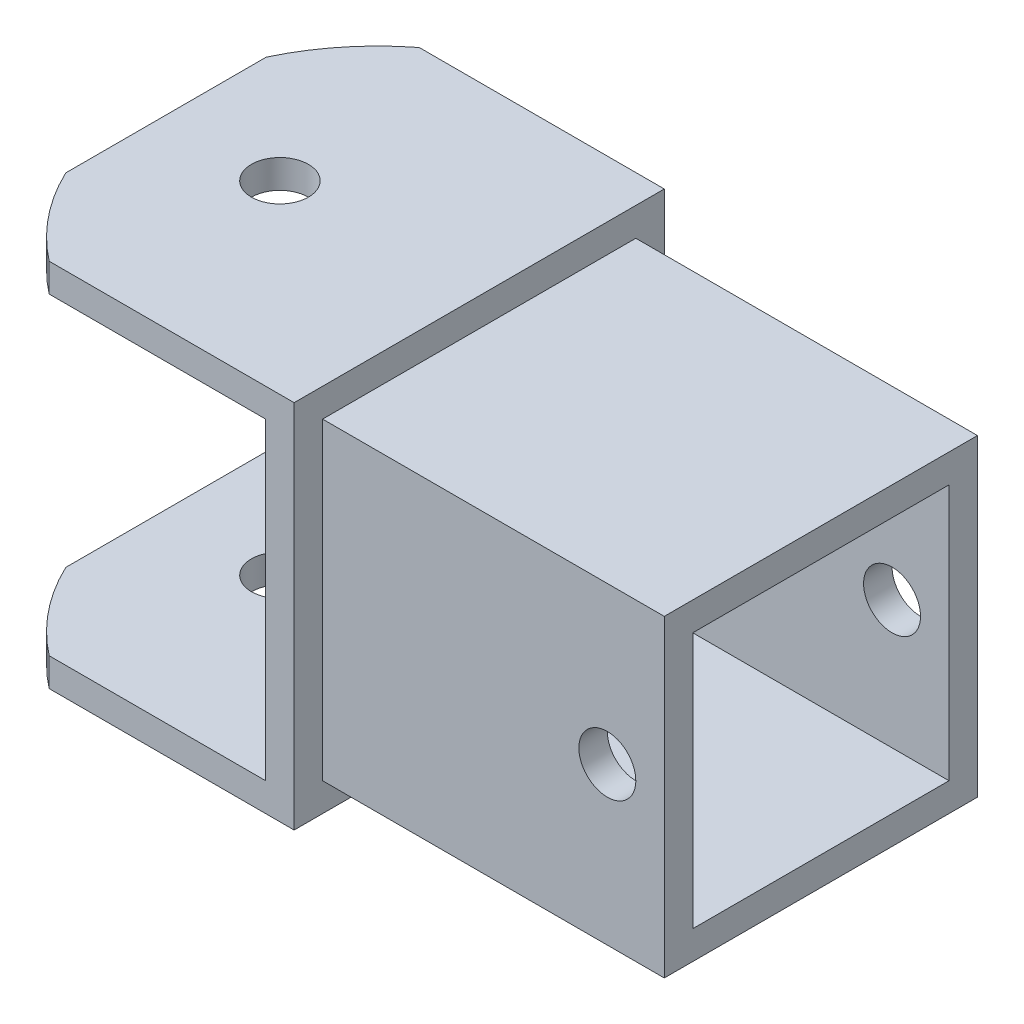
ISO-10303-21;
HEADER;
FILE_DESCRIPTION(('STEP AP214'),'2;1');
FILE_NAME('part.step','',(''),(''),'','','');
FILE_SCHEMA(('AUTOMOTIVE_DESIGN { 1 0 10303 214 1 1 1 1 }'));
ENDSEC;
DATA;
#1=APPLICATION_CONTEXT('core data for automotive mechanical design processes');
#2=APPLICATION_PROTOCOL_DEFINITION('international standard','automotive_design',2000,#1);
#3=PRODUCT_CONTEXT('',#1,'mechanical');
#4=PRODUCT('Part','Part','',(#3));
#5=PRODUCT_RELATED_PRODUCT_CATEGORY('part','',(#4));
#6=PRODUCT_DEFINITION_FORMATION('','',#4);
#7=PRODUCT_DEFINITION_CONTEXT('part definition',#1,'design');
#8=PRODUCT_DEFINITION('design','',#6,#7);
#9=PRODUCT_DEFINITION_SHAPE('','',#8);
#10=(LENGTH_UNIT() NAMED_UNIT(*) SI_UNIT(.MILLI.,.METRE.));
#11=(NAMED_UNIT(*) PLANE_ANGLE_UNIT() SI_UNIT($,.RADIAN.));
#12=(NAMED_UNIT(*) SI_UNIT($,.STERADIAN.) SOLID_ANGLE_UNIT());
#13=UNCERTAINTY_MEASURE_WITH_UNIT(LENGTH_MEASURE(1.E-05),#10,'distance_accuracy_value','');
#14=(GEOMETRIC_REPRESENTATION_CONTEXT(3) GLOBAL_UNCERTAINTY_ASSIGNED_CONTEXT((#13)) GLOBAL_UNIT_ASSIGNED_CONTEXT((#10,
#11,#12)) REPRESENTATION_CONTEXT('',''));
#15=CARTESIAN_POINT('',(0.,0.,0.));
#16=DIRECTION('',(0.,0.,1.));
#17=DIRECTION('',(1.,0.,0.));
#18=AXIS2_PLACEMENT_3D('',#15,#16,#17);
#19=CARTESIAN_POINT('',(-50.8,82.5502499999997,114.30025));
#20=DIRECTION('',(1.,0.,0.));
#21=DIRECTION('',(0.,1.,0.));
#22=AXIS2_PLACEMENT_3D('',#19,#20,#21);
#23=PLANE('',#22);
#24=DIRECTION('',(0.,-1.,0.));
#25=VECTOR('',#24,1.);
#26=CARTESIAN_POINT('',(-50.8,82.5502499999997,76.4548080116448));
#27=LINE('',#26,#25);
#28=CARTESIAN_POINT('',(-50.8,82.5502499999999,76.4548080116448));
#29=VERTEX_POINT('',#28);
#30=CARTESIAN_POINT('',(-50.8,69.8502499999999,76.4548080116448));
#31=VERTEX_POINT('',#30);
#32=EDGE_CURVE('E239',#29,#31,#27,.T.);
#33=ORIENTED_EDGE('',*,*,#32,.F.);
#34=DIRECTION('',(0.,0.,-1.));
#35=VECTOR('',#34,1.);
#36=CARTESIAN_POINT('',(-50.8,82.5502499999997,114.30025));
#37=LINE('',#36,#35);
#38=CARTESIAN_POINT('',(-50.8,82.5502500000002,-12.9543080116442));
#39=VERTEX_POINT('',#38);
#40=EDGE_CURVE('E197',#29,#39,#37,.T.);
#41=ORIENTED_EDGE('',*,*,#40,.T.);
#42=DIRECTION('',(0.,-1.,0.));
#43=VECTOR('',#42,1.);
#44=CARTESIAN_POINT('',(-50.8,82.55025,-12.9543080116442));
#45=LINE('',#44,#43);
#46=CARTESIAN_POINT('',(-50.8,69.8502500000002,-12.9543080116443));
#47=VERTEX_POINT('',#46);
#48=EDGE_CURVE('E313',#47,#39,#45,.F.);
#49=ORIENTED_EDGE('',*,*,#48,.F.);
#50=DIRECTION('',(0.,0.,-1.));
#51=VECTOR('',#50,1.);
#52=CARTESIAN_POINT('',(-50.8,69.8502499999997,114.30025));
#53=LINE('',#52,#51);
#54=EDGE_CURVE('E51',#31,#47,#53,.T.);
#55=ORIENTED_EDGE('',*,*,#54,.F.);
#56=EDGE_LOOP('',(#33,#41,#49,#55));
#57=FACE_BOUND('',#56,.T.);
#58=ADVANCED_FACE('F41',(#57),#23,.F.);
#59=CARTESIAN_POINT('',(-50.8,69.8502499999997,114.30025));
#60=DIRECTION('',(0.,1.,0.));
#61=DIRECTION('',(-1.,0.,0.));
#62=AXIS2_PLACEMENT_3D('',#59,#60,#61);
#63=PLANE('',#62);
#64=CARTESIAN_POINT('',(0.,69.85025,31.7502500000002));
#65=DIRECTION('',(0.,1.,0.));
#66=DIRECTION('',(-1.,0.,0.));
#67=AXIS2_PLACEMENT_3D('',#64,#65,#66);
#68=CIRCLE('',#67,12.7);
#69=CARTESIAN_POINT('',(-12.7,69.85025,31.7502500000002));
#70=VERTEX_POINT('',#69);
#71=EDGE_CURVE('E341',#70,#70,#68,.T.);
#72=ORIENTED_EDGE('',*,*,#71,.T.);
#73=EDGE_LOOP('',(#72));
#74=FACE_BOUND('',#73,.T.);
#75=CARTESIAN_POINT('',(43.5564957867523,69.85025,31.7502500000002));
#76=DIRECTION('',(0.,1.,0.));
#77=DIRECTION('',(-1.,0.,0.));
#78=AXIS2_PLACEMENT_3D('',#75,#76,#77);
#79=CIRCLE('',#78,104.410946764082);
#80=CARTESIAN_POINT('',(-20.3742738329848,69.8502499999997,114.30025));
#81=VERTEX_POINT('',#80);
#82=EDGE_CURVE('E67',#31,#81,#79,.T.);
#83=ORIENTED_EDGE('',*,*,#82,.F.);
#84=ORIENTED_EDGE('',*,*,#54,.T.);
#85=CARTESIAN_POINT('',(-20.3742738329847,69.8502500000003,-50.7997499999997));
#86=VERTEX_POINT('',#85);
#87=EDGE_CURVE('E310',#86,#47,#79,.T.);
#88=ORIENTED_EDGE('',*,*,#87,.F.);
#89=DIRECTION('',(1.,0.,0.));
#90=VECTOR('',#89,1.);
#91=CARTESIAN_POINT('',(-50.8,69.8502500000003,-50.7997499999997));
#92=LINE('',#91,#90);
#93=CARTESIAN_POINT('',(76.2,69.8502500000003,-50.7997499999997));
#94=VERTEX_POINT('',#93);
#95=EDGE_CURVE('E214',#86,#94,#92,.T.);
#96=ORIENTED_EDGE('',*,*,#95,.T.);
#97=DIRECTION('',(0.,0.,-1.));
#98=VECTOR('',#97,1.);
#99=CARTESIAN_POINT('',(76.2,69.8502499999997,114.30025));
#100=LINE('',#99,#98);
#101=CARTESIAN_POINT('',(76.2,69.8502499999997,114.30025));
#102=VERTEX_POINT('',#101);
#103=EDGE_CURVE('E243',#102,#94,#100,.T.);
#104=ORIENTED_EDGE('',*,*,#103,.F.);
#105=DIRECTION('',(1.,0.,0.));
#106=VECTOR('',#105,1.);
#107=CARTESIAN_POINT('',(-50.8,69.8502499999997,114.30025));
#108=LINE('',#107,#106);
#109=EDGE_CURVE('E267',#81,#102,#108,.T.);
#110=ORIENTED_EDGE('',*,*,#109,.F.);
#111=EDGE_LOOP('',(#83,#84,#88,#96,#104,#110));
#112=FACE_BOUND('',#111,.T.);
#113=ADVANCED_FACE('F457',(#74,#112),#63,.F.);
#114=CARTESIAN_POINT('',(76.2,-69.8497500000003,114.30025));
#115=DIRECTION('',(0.,-1.,0.));
#116=DIRECTION('',(1.,0.,0.));
#117=AXIS2_PLACEMENT_3D('',#114,#115,#116);
#118=PLANE('',#117);
#119=CARTESIAN_POINT('',(0.,-69.84975,31.7502499999998));
#120=DIRECTION('',(0.,-1.,0.));
#121=DIRECTION('',(1.,0.,0.));
#122=AXIS2_PLACEMENT_3D('',#119,#120,#121);
#123=CIRCLE('',#122,12.7);
#124=CARTESIAN_POINT('',(12.7,-69.84975,31.7502499999998));
#125=VERTEX_POINT('',#124);
#126=EDGE_CURVE('E337',#125,#125,#123,.T.);
#127=ORIENTED_EDGE('',*,*,#126,.T.);
#128=EDGE_LOOP('',(#127));
#129=FACE_BOUND('',#128,.T.);
#130=CARTESIAN_POINT('',(43.5564957867523,-69.84975,31.7502499999998));
#131=DIRECTION('',(0.,-1.,0.));
#132=DIRECTION('',(1.,0.,0.));
#133=AXIS2_PLACEMENT_3D('',#130,#131,#132);
#134=CIRCLE('',#133,104.410946764082);
#135=CARTESIAN_POINT('',(-20.3742738329847,-69.8497500000003,114.30025));
#136=VERTEX_POINT('',#135);
#137=CARTESIAN_POINT('',(-50.7999999999997,-69.8497500000001,76.4548080116449));
#138=VERTEX_POINT('',#137);
#139=EDGE_CURVE('E309',#136,#138,#134,.T.);
#140=ORIENTED_EDGE('',*,*,#139,.F.);
#141=DIRECTION('',(-1.,0.,0.));
#142=VECTOR('',#141,1.);
#143=CARTESIAN_POINT('',(76.2,-69.8497500000003,114.30025));
#144=LINE('',#143,#142);
#145=CARTESIAN_POINT('',(76.2,-69.8497500000003,114.30025));
#146=VERTEX_POINT('',#145);
#147=EDGE_CURVE('E433',#146,#136,#144,.T.);
#148=ORIENTED_EDGE('',*,*,#147,.F.);
#149=DIRECTION('',(0.,0.,-1.));
#150=VECTOR('',#149,1.);
#151=CARTESIAN_POINT('',(76.2,-69.8497500000003,114.30025));
#152=LINE('',#151,#150);
#153=CARTESIAN_POINT('',(76.2,-69.8497499999997,-50.7997500000002));
#154=VERTEX_POINT('',#153);
#155=EDGE_CURVE('E247',#146,#154,#152,.T.);
#156=ORIENTED_EDGE('',*,*,#155,.T.);
#157=DIRECTION('',(-1.,0.,0.));
#158=VECTOR('',#157,1.);
#159=CARTESIAN_POINT('',(76.2,-69.8497499999997,-50.7997500000002));
#160=LINE('',#159,#158);
#161=CARTESIAN_POINT('',(-20.3742738329848,-69.8497499999997,-50.7997500000002));
#162=VERTEX_POINT('',#161);
#163=EDGE_CURVE('E221',#154,#162,#160,.T.);
#164=ORIENTED_EDGE('',*,*,#163,.T.);
#165=CARTESIAN_POINT('',(-50.7999999999997,-69.8497499999998,-12.9543080116454));
#166=VERTEX_POINT('',#165);
#167=EDGE_CURVE('E306',#166,#162,#134,.T.);
#168=ORIENTED_EDGE('',*,*,#167,.F.);
#169=DIRECTION('',(0.,0.,-1.));
#170=VECTOR('',#169,1.);
#171=CARTESIAN_POINT('',(-50.8,-69.8497500000003,114.30025));
#172=LINE('',#171,#170);
#173=EDGE_CURVE('E251',#138,#166,#172,.T.);
#174=ORIENTED_EDGE('',*,*,#173,.F.);
#175=EDGE_LOOP('',(#140,#148,#156,#164,#168,#174));
#176=FACE_BOUND('',#175,.T.);
#177=ADVANCED_FACE('F449',(#129,#176),#118,.F.);
#178=CARTESIAN_POINT('',(-50.8,-69.8497500000003,114.30025));
#179=DIRECTION('',(1.,0.,0.));
#180=DIRECTION('',(0.,1.,0.));
#181=AXIS2_PLACEMENT_3D('',#178,#179,#180);
#182=PLANE('',#181);
#183=DIRECTION('',(0.,-1.,0.));
#184=VECTOR('',#183,1.);
#185=CARTESIAN_POINT('',(-50.7999999999997,82.55025,76.4548080116454));
#186=LINE('',#185,#184);
#187=CARTESIAN_POINT('',(-50.8,-82.5497500000001,76.4548080116443));
#188=VERTEX_POINT('',#187);
#189=EDGE_CURVE('E305',#138,#188,#186,.T.);
#190=ORIENTED_EDGE('',*,*,#189,.F.);
#191=ORIENTED_EDGE('',*,*,#173,.T.);
#192=DIRECTION('',(0.,-1.,0.));
#193=VECTOR('',#192,1.);
#194=CARTESIAN_POINT('',(-50.7999999999997,82.5502500000003,-12.9543080116448));
#195=LINE('',#194,#193);
#196=CARTESIAN_POINT('',(-50.8,-82.5497499999998,-12.9543080116448));
#197=VERTEX_POINT('',#196);
#198=EDGE_CURVE('E297',#197,#166,#195,.F.);
#199=ORIENTED_EDGE('',*,*,#198,.F.);
#200=DIRECTION('',(0.,0.,-1.));
#201=VECTOR('',#200,1.);
#202=CARTESIAN_POINT('',(-50.8,-82.5497500000003,114.30025));
#203=LINE('',#202,#201);
#204=EDGE_CURVE('E255',#188,#197,#203,.T.);
#205=ORIENTED_EDGE('',*,*,#204,.F.);
#206=EDGE_LOOP('',(#190,#191,#199,#205));
#207=FACE_BOUND('',#206,.T.);
#208=ADVANCED_FACE('F471',(#207),#182,.F.);
#209=CARTESIAN_POINT('',(-50.8,-82.5497500000003,114.30025));
#210=DIRECTION('',(0.,1.,0.));
#211=DIRECTION('',(-1.,0.,0.));
#212=AXIS2_PLACEMENT_3D('',#209,#210,#211);
#213=PLANE('',#212);
#214=CARTESIAN_POINT('',(0.,-82.54975,31.7502499999997));
#215=DIRECTION('',(0.,1.,0.));
#216=DIRECTION('',(-1.,0.,0.));
#217=AXIS2_PLACEMENT_3D('',#214,#215,#216);
#218=CIRCLE('',#217,12.7);
#219=CARTESIAN_POINT('',(-12.7,-82.54975,31.7502499999997));
#220=VERTEX_POINT('',#219);
#221=EDGE_CURVE('E333',#220,#220,#218,.T.);
#222=ORIENTED_EDGE('',*,*,#221,.T.);
#223=EDGE_LOOP('',(#222));
#224=FACE_BOUND('',#223,.T.);
#225=CARTESIAN_POINT('',(43.5564957867523,-82.54975,31.7502499999997));
#226=DIRECTION('',(0.,1.,0.));
#227=DIRECTION('',(-1.,0.,0.));
#228=AXIS2_PLACEMENT_3D('',#225,#226,#227);
#229=CIRCLE('',#228,104.410946764082);
#230=CARTESIAN_POINT('',(-20.3742738329848,-82.5497500000003,114.30025));
#231=VERTEX_POINT('',#230);
#232=EDGE_CURVE('E59',#188,#231,#229,.T.);
#233=ORIENTED_EDGE('',*,*,#232,.F.);
#234=ORIENTED_EDGE('',*,*,#204,.T.);
#235=CARTESIAN_POINT('',(-20.3742738329847,-82.5497499999997,-50.7997500000003));
#236=VERTEX_POINT('',#235);
#237=EDGE_CURVE('E186',#236,#197,#229,.T.);
#238=ORIENTED_EDGE('',*,*,#237,.F.);
#239=DIRECTION('',(1.,0.,0.));
#240=VECTOR('',#239,1.);
#241=CARTESIAN_POINT('',(-50.8,-82.5497499999997,-50.7997500000003));
#242=LINE('',#241,#240);
#243=CARTESIAN_POINT('',(88.9000000000001,-82.5497499999997,-50.7997500000003));
#244=VERTEX_POINT('',#243);
#245=EDGE_CURVE('E225',#236,#244,#242,.T.);
#246=ORIENTED_EDGE('',*,*,#245,.T.);
#247=DIRECTION('',(0.,0.,-1.));
#248=VECTOR('',#247,1.);
#249=CARTESIAN_POINT('',(88.9000000000001,-82.5497500000003,114.30025));
#250=LINE('',#249,#248);
#251=CARTESIAN_POINT('',(88.9000000000001,-82.5497500000003,114.30025));
#252=VERTEX_POINT('',#251);
#253=EDGE_CURVE('E259',#252,#244,#250,.T.);
#254=ORIENTED_EDGE('',*,*,#253,.F.);
#255=DIRECTION('',(1.,0.,0.));
#256=VECTOR('',#255,1.);
#257=CARTESIAN_POINT('',(-50.8,-82.5497500000003,114.30025));
#258=LINE('',#257,#256);
#259=EDGE_CURVE('E44',#231,#252,#258,.T.);
#260=ORIENTED_EDGE('',*,*,#259,.F.);
#261=EDGE_LOOP('',(#233,#234,#238,#246,#254,#260));
#262=FACE_BOUND('',#261,.T.);
#263=ADVANCED_FACE('F441',(#224,#262),#213,.F.);
#264=CARTESIAN_POINT('',(88.9,82.5502499999997,114.30025));
#265=DIRECTION('',(0.,-1.,0.));
#266=DIRECTION('',(1.,0.,0.));
#267=AXIS2_PLACEMENT_3D('',#264,#265,#266);
#268=PLANE('',#267);
#269=CARTESIAN_POINT('',(0.,82.55025,31.7502500000003));
#270=DIRECTION('',(0.,-1.,0.));
#271=DIRECTION('',(1.,0.,0.));
#272=AXIS2_PLACEMENT_3D('',#269,#270,#271);
#273=CIRCLE('',#272,12.7);
#274=CARTESIAN_POINT('',(12.7,82.55025,31.7502500000003));
#275=VERTEX_POINT('',#274);
#276=EDGE_CURVE('E329',#275,#275,#273,.T.);
#277=ORIENTED_EDGE('',*,*,#276,.T.);
#278=EDGE_LOOP('',(#277));
#279=FACE_BOUND('',#278,.T.);
#280=CARTESIAN_POINT('',(43.5564957867523,82.55025,31.7502500000003));
#281=DIRECTION('',(0.,-1.,0.));
#282=DIRECTION('',(1.,0.,0.));
#283=AXIS2_PLACEMENT_3D('',#280,#281,#282);
#284=CIRCLE('',#283,104.410946764082);
#285=CARTESIAN_POINT('',(-20.3742738329847,82.5502499999997,114.30025));
#286=VERTEX_POINT('',#285);
#287=EDGE_CURVE('E180',#286,#29,#284,.T.);
#288=ORIENTED_EDGE('',*,*,#287,.F.);
#289=DIRECTION('',(-1.,0.,0.));
#290=VECTOR('',#289,1.);
#291=CARTESIAN_POINT('',(88.9,82.5502499999997,114.30025));
#292=LINE('',#291,#290);
#293=CARTESIAN_POINT('',(88.9,82.5502499999997,114.30025));
#294=VERTEX_POINT('',#293);
#295=EDGE_CURVE('E194',#294,#286,#292,.T.);
#296=ORIENTED_EDGE('',*,*,#295,.F.);
#297=DIRECTION('',(0.,0.,-1.));
#298=VECTOR('',#297,1.);
#299=CARTESIAN_POINT('',(88.9,82.5502499999997,114.30025));
#300=LINE('',#299,#298);
#301=CARTESIAN_POINT('',(88.9,82.5502500000003,-50.7997499999997));
#302=VERTEX_POINT('',#301);
#303=EDGE_CURVE('E210',#294,#302,#300,.T.);
#304=ORIENTED_EDGE('',*,*,#303,.T.);
#305=DIRECTION('',(-1.,0.,0.));
#306=VECTOR('',#305,1.);
#307=CARTESIAN_POINT('',(88.9,82.5502500000003,-50.7997499999997));
#308=LINE('',#307,#306);
#309=CARTESIAN_POINT('',(-20.3742738329847,82.5502500000003,-50.7997499999997));
#310=VERTEX_POINT('',#309);
#311=EDGE_CURVE('E264',#302,#310,#308,.T.);
#312=ORIENTED_EDGE('',*,*,#311,.T.);
#313=EDGE_CURVE('E200',#39,#310,#284,.T.);
#314=ORIENTED_EDGE('',*,*,#313,.F.);
#315=ORIENTED_EDGE('',*,*,#40,.F.);
#316=EDGE_LOOP('',(#288,#296,#304,#312,#314,#315));
#317=FACE_BOUND('',#316,.T.);
#318=ADVANCED_FACE('F192',(#279,#317),#268,.F.);
#319=CARTESIAN_POINT('',(0.,31.7502499999997,114.30025));
#320=DIRECTION('',(0.,0.,1.));
#321=DIRECTION('',(0.,-1.,0.));
#322=AXIS2_PLACEMENT_3D('',#319,#320,#321);
#323=PLANE('',#322);
#324=ORIENTED_EDGE('',*,*,#295,.T.);
#325=DIRECTION('',(0.,-1.,0.));
#326=VECTOR('',#325,1.);
#327=CARTESIAN_POINT('',(-20.3742738329847,82.5502499999997,114.30025));
#328=LINE('',#327,#326);
#329=EDGE_CURVE('E177',#286,#81,#328,.T.);
#330=ORIENTED_EDGE('',*,*,#329,.T.);
#331=ORIENTED_EDGE('',*,*,#109,.T.);
#332=DIRECTION('',(0.,-1.,0.));
#333=VECTOR('',#332,1.);
#334=CARTESIAN_POINT('',(76.2,69.8502499999997,114.30025));
#335=LINE('',#334,#333);
#336=EDGE_CURVE('E271',#102,#146,#335,.T.);
#337=ORIENTED_EDGE('',*,*,#336,.T.);
#338=ORIENTED_EDGE('',*,*,#147,.T.);
#339=EDGE_CURVE('E187',#136,#231,#328,.T.);
#340=ORIENTED_EDGE('',*,*,#339,.T.);
#341=ORIENTED_EDGE('',*,*,#259,.T.);
#342=DIRECTION('',(0.,1.,0.));
#343=VECTOR('',#342,1.);
#344=CARTESIAN_POINT('',(88.9000000000001,-82.5497500000003,114.30025));
#345=LINE('',#344,#343);
#346=EDGE_CURVE('E204',#252,#294,#345,.T.);
#347=ORIENTED_EDGE('',*,*,#346,.T.);
#348=EDGE_LOOP('',(#324,#330,#331,#337,#338,#340,#341,#347));
#349=FACE_BOUND('',#348,.T.);
#350=ADVANCED_FACE('F202',(#349),#323,.T.);
#351=CARTESIAN_POINT('',(0.,31.7502500000003,-50.7997499999999));
#352=DIRECTION('',(0.,0.,1.));
#353=DIRECTION('',(0.,-1.,0.));
#354=AXIS2_PLACEMENT_3D('',#351,#352,#353);
#355=PLANE('',#354);
#356=DIRECTION('',(0.,-1.,0.));
#357=VECTOR('',#356,1.);
#358=CARTESIAN_POINT('',(-20.3742738329847,82.5502500000003,-50.7997499999997));
#359=LINE('',#358,#357);
#360=EDGE_CURVE('E199',#310,#86,#359,.T.);
#361=ORIENTED_EDGE('',*,*,#360,.F.);
#362=ORIENTED_EDGE('',*,*,#311,.F.);
#363=DIRECTION('',(0.,1.,0.));
#364=VECTOR('',#363,1.);
#365=CARTESIAN_POINT('',(88.9000000000001,-82.5497499999997,-50.7997500000003));
#366=LINE('',#365,#364);
#367=EDGE_CURVE('E228',#244,#302,#366,.T.);
#368=ORIENTED_EDGE('',*,*,#367,.F.);
#369=ORIENTED_EDGE('',*,*,#245,.F.);
#370=DIRECTION('',(0.,-1.,0.));
#371=VECTOR('',#370,1.);
#372=CARTESIAN_POINT('',(-20.3742738329848,82.5502500000003,-50.7997499999997));
#373=LINE('',#372,#371);
#374=EDGE_CURVE('E11',#162,#236,#373,.T.);
#375=ORIENTED_EDGE('',*,*,#374,.F.);
#376=ORIENTED_EDGE('',*,*,#163,.F.);
#377=DIRECTION('',(0.,-1.,0.));
#378=VECTOR('',#377,1.);
#379=CARTESIAN_POINT('',(76.2,69.8502500000003,-50.7997499999997));
#380=LINE('',#379,#378);
#381=EDGE_CURVE('E217',#94,#154,#380,.T.);
#382=ORIENTED_EDGE('',*,*,#381,.F.);
#383=ORIENTED_EDGE('',*,*,#95,.F.);
#384=EDGE_LOOP('',(#361,#362,#368,#369,#375,#376,#382,#383));
#385=FACE_BOUND('',#384,.T.);
#386=ADVANCED_FACE('F281',(#385),#355,.F.);
#387=CARTESIAN_POINT('',(88.9000000000001,-82.5497500000003,114.30025));
#388=DIRECTION('',(-1.,0.,0.));
#389=DIRECTION('',(0.,-1.,0.));
#390=AXIS2_PLACEMENT_3D('',#387,#388,#389);
#391=PLANE('',#390);
#392=ORIENTED_EDGE('',*,*,#367,.T.);
#393=ORIENTED_EDGE('',*,*,#303,.F.);
#394=ORIENTED_EDGE('',*,*,#346,.F.);
#395=ORIENTED_EDGE('',*,*,#253,.T.);
#396=EDGE_LOOP('',(#392,#393,#394,#395));
#397=FACE_BOUND('',#396,.T.);
#398=DIRECTION('',(0.,0.,1.));
#399=VECTOR('',#398,1.);
#400=CARTESIAN_POINT('',(88.9,69.8502499999998,101.60025));
#401=LINE('',#400,#399);
#402=CARTESIAN_POINT('',(88.9,69.8502500000003,-38.0997499999997));
#403=VERTEX_POINT('',#402);
#404=CARTESIAN_POINT('',(88.9,69.8502499999997,101.60025));
#405=VERTEX_POINT('',#404);
#406=EDGE_CURVE('E387',#403,#405,#401,.T.);
#407=ORIENTED_EDGE('',*,*,#406,.F.);
#408=DIRECTION('',(0.,1.,0.));
#409=VECTOR('',#408,1.);
#410=CARTESIAN_POINT('',(88.9,-69.8497499999997,-38.0997500000002));
#411=LINE('',#410,#409);
#412=CARTESIAN_POINT('',(88.9000000000001,-69.8497499999997,-38.0997500000002));
#413=VERTEX_POINT('',#412);
#414=EDGE_CURVE('E393',#413,#403,#411,.T.);
#415=ORIENTED_EDGE('',*,*,#414,.F.);
#416=DIRECTION('',(0.,0.,-1.));
#417=VECTOR('',#416,1.);
#418=CARTESIAN_POINT('',(88.9,-69.8497500000002,101.60025));
#419=LINE('',#418,#417);
#420=CARTESIAN_POINT('',(88.9000000000001,-69.8497500000002,101.60025));
#421=VERTEX_POINT('',#420);
#422=EDGE_CURVE('E410',#421,#413,#419,.T.);
#423=ORIENTED_EDGE('',*,*,#422,.F.);
#424=DIRECTION('',(0.,-1.,0.));
#425=VECTOR('',#424,1.);
#426=CARTESIAN_POINT('',(88.9,-69.8497500000002,101.60025));
#427=LINE('',#426,#425);
#428=EDGE_CURVE('E406',#405,#421,#427,.T.);
#429=ORIENTED_EDGE('',*,*,#428,.F.);
#430=EDGE_LOOP('',(#407,#415,#423,#429));
#431=FACE_BOUND('',#430,.T.);
#432=ADVANCED_FACE('F275',(#397,#431),#391,.F.);
#433=CARTESIAN_POINT('',(76.2,69.8502499999997,114.30025));
#434=DIRECTION('',(1.,0.,0.));
#435=DIRECTION('',(0.,1.,0.));
#436=AXIS2_PLACEMENT_3D('',#433,#434,#435);
#437=PLANE('',#436);
#438=ORIENTED_EDGE('',*,*,#381,.T.);
#439=ORIENTED_EDGE('',*,*,#155,.F.);
#440=ORIENTED_EDGE('',*,*,#336,.F.);
#441=ORIENTED_EDGE('',*,*,#103,.T.);
#442=EDGE_LOOP('',(#438,#439,#440,#441));
#443=FACE_BOUND('',#442,.T.);
#444=ADVANCED_FACE('F454',(#443),#437,.F.);
#445=CARTESIAN_POINT('',(241.3,31.75025,31.7502500000001));
#446=DIRECTION('',(1.,0.,0.));
#447=DIRECTION('',(0.,1.,0.));
#448=AXIS2_PLACEMENT_3D('',#445,#446,#447);
#449=PLANE('',#448);
#450=DIRECTION('',(0.,0.,1.));
#451=VECTOR('',#450,1.);
#452=CARTESIAN_POINT('',(241.3,69.8502499999997,101.60025));
#453=LINE('',#452,#451);
#454=CARTESIAN_POINT('',(241.3,69.8502500000002,-38.0997499999997));
#455=VERTEX_POINT('',#454);
#456=CARTESIAN_POINT('',(241.3,69.8502499999997,101.60025));
#457=VERTEX_POINT('',#456);
#458=EDGE_CURVE('E388',#455,#457,#453,.T.);
#459=ORIENTED_EDGE('',*,*,#458,.T.);
#460=DIRECTION('',(0.,-1.,0.));
#461=VECTOR('',#460,1.);
#462=CARTESIAN_POINT('',(241.3,-69.8497500000002,101.60025));
#463=LINE('',#462,#461);
#464=CARTESIAN_POINT('',(241.3,-69.8497500000002,101.60025));
#465=VERTEX_POINT('',#464);
#466=EDGE_CURVE('E392',#457,#465,#463,.T.);
#467=ORIENTED_EDGE('',*,*,#466,.T.);
#468=DIRECTION('',(0.,0.,-1.));
#469=VECTOR('',#468,1.);
#470=CARTESIAN_POINT('',(241.3,-69.8497500000002,101.60025));
#471=LINE('',#470,#469);
#472=CARTESIAN_POINT('',(241.3,-69.8497499999997,-38.0997500000002));
#473=VERTEX_POINT('',#472);
#474=EDGE_CURVE('E396',#465,#473,#471,.T.);
#475=ORIENTED_EDGE('',*,*,#474,.T.);
#476=DIRECTION('',(0.,1.,0.));
#477=VECTOR('',#476,1.);
#478=CARTESIAN_POINT('',(241.3,-69.8497499999997,-38.0997500000002));
#479=LINE('',#478,#477);
#480=EDGE_CURVE('E399',#473,#455,#479,.T.);
#481=ORIENTED_EDGE('',*,*,#480,.T.);
#482=EDGE_LOOP('',(#459,#467,#475,#481));
#483=FACE_BOUND('',#482,.T.);
#484=DIRECTION('',(0.,-1.,0.));
#485=VECTOR('',#484,1.);
#486=CARTESIAN_POINT('',(241.3,-57.1497500000002,88.9002499999999));
#487=LINE('',#486,#485);
#488=CARTESIAN_POINT('',(241.3,57.1502499999998,88.9002500000003));
#489=VERTEX_POINT('',#488);
#490=CARTESIAN_POINT('',(241.3,-57.1497500000002,88.9002499999999));
#491=VERTEX_POINT('',#490);
#492=EDGE_CURVE('E349',#489,#491,#487,.T.);
#493=ORIENTED_EDGE('',*,*,#492,.F.);
#494=DIRECTION('',(0.,0.,1.));
#495=VECTOR('',#494,1.);
#496=CARTESIAN_POINT('',(241.3,57.1502499999998,88.9002500000003));
#497=LINE('',#496,#495);
#498=CARTESIAN_POINT('',(241.3,57.1502500000002,-25.3997499999998));
#499=VERTEX_POINT('',#498);
#500=EDGE_CURVE('E346',#499,#489,#497,.T.);
#501=ORIENTED_EDGE('',*,*,#500,.F.);
#502=DIRECTION('',(0.,1.,0.));
#503=VECTOR('',#502,1.);
#504=CARTESIAN_POINT('',(241.3,-57.1497499999998,-25.3997500000002));
#505=LINE('',#504,#503);
#506=CARTESIAN_POINT('',(241.3,-57.1497499999998,-25.3997500000002));
#507=VERTEX_POINT('',#506);
#508=EDGE_CURVE('E357',#507,#499,#505,.T.);
#509=ORIENTED_EDGE('',*,*,#508,.F.);
#510=DIRECTION('',(0.,0.,-1.));
#511=VECTOR('',#510,1.);
#512=CARTESIAN_POINT('',(241.3,-57.1497500000002,88.9002499999999));
#513=LINE('',#512,#511);
#514=EDGE_CURVE('E353',#491,#507,#513,.T.);
#515=ORIENTED_EDGE('',*,*,#514,.F.);
#516=EDGE_LOOP('',(#493,#501,#509,#515));
#517=FACE_BOUND('',#516,.T.);
#518=ADVANCED_FACE('F494',(#483,#517),#449,.T.);
#519=CARTESIAN_POINT('',(241.3,69.8502499999997,101.60025));
#520=DIRECTION('',(0.,-1.,0.));
#521=DIRECTION('',(1.,0.,0.));
#522=AXIS2_PLACEMENT_3D('',#519,#520,#521);
#523=PLANE('',#522);
#524=ORIENTED_EDGE('',*,*,#406,.T.);
#525=DIRECTION('',(-1.,0.,0.));
#526=VECTOR('',#525,1.);
#527=CARTESIAN_POINT('',(241.3,69.8502499999997,101.60025));
#528=LINE('',#527,#526);
#529=EDGE_CURVE('E218',#457,#405,#528,.T.);
#530=ORIENTED_EDGE('',*,*,#529,.F.);
#531=ORIENTED_EDGE('',*,*,#458,.F.);
#532=DIRECTION('',(-1.,0.,0.));
#533=VECTOR('',#532,1.);
#534=CARTESIAN_POINT('',(241.3,69.8502500000002,-38.0997499999997));
#535=LINE('',#534,#533);
#536=EDGE_CURVE('E402',#455,#403,#535,.T.);
#537=ORIENTED_EDGE('',*,*,#536,.T.);
#538=EDGE_LOOP('',(#524,#530,#531,#537));
#539=FACE_BOUND('',#538,.T.);
#540=ADVANCED_FACE('F514',(#539),#523,.F.);
#541=CARTESIAN_POINT('',(241.3,-69.8497500000002,101.60025));
#542=DIRECTION('',(0.,0.,-1.));
#543=DIRECTION('',(0.,1.,0.));
#544=AXIS2_PLACEMENT_3D('',#541,#542,#543);
#545=PLANE('',#544);
#546=CARTESIAN_POINT('',(215.9,0.000249999999757389,101.60025));
#547=DIRECTION('',(0.,0.,-1.));
#548=DIRECTION('',(0.,1.,0.));
#549=AXIS2_PLACEMENT_3D('',#546,#547,#548);
#550=CIRCLE('',#549,12.7);
#551=CARTESIAN_POINT('',(215.9,12.7002499999998,101.60025));
#552=VERTEX_POINT('',#551);
#553=EDGE_CURVE('E325',#552,#552,#550,.T.);
#554=ORIENTED_EDGE('',*,*,#553,.T.);
#555=EDGE_LOOP('',(#554));
#556=FACE_BOUND('',#555,.T.);
#557=ORIENTED_EDGE('',*,*,#428,.T.);
#558=DIRECTION('',(-1.,0.,0.));
#559=VECTOR('',#558,1.);
#560=CARTESIAN_POINT('',(241.3,-69.8497500000002,101.60025));
#561=LINE('',#560,#559);
#562=EDGE_CURVE('E424',#465,#421,#561,.T.);
#563=ORIENTED_EDGE('',*,*,#562,.F.);
#564=ORIENTED_EDGE('',*,*,#466,.F.);
#565=ORIENTED_EDGE('',*,*,#529,.T.);
#566=EDGE_LOOP('',(#557,#563,#564,#565));
#567=FACE_BOUND('',#566,.T.);
#568=ADVANCED_FACE('F517',(#556,#567),#545,.F.);
#569=CARTESIAN_POINT('',(241.3,-69.8497500000002,101.60025));
#570=DIRECTION('',(0.,1.,0.));
#571=DIRECTION('',(-1.,0.,0.));
#572=AXIS2_PLACEMENT_3D('',#569,#570,#571);
#573=PLANE('',#572);
#574=ORIENTED_EDGE('',*,*,#422,.T.);
#575=DIRECTION('',(-1.,0.,0.));
#576=VECTOR('',#575,1.);
#577=CARTESIAN_POINT('',(241.3,-69.8497499999997,-38.0997500000002));
#578=LINE('',#577,#576);
#579=EDGE_CURVE('E420',#473,#413,#578,.T.);
#580=ORIENTED_EDGE('',*,*,#579,.F.);
#581=ORIENTED_EDGE('',*,*,#474,.F.);
#582=ORIENTED_EDGE('',*,*,#562,.T.);
#583=EDGE_LOOP('',(#574,#580,#581,#582));
#584=FACE_BOUND('',#583,.T.);
#585=ADVANCED_FACE('F521',(#584),#573,.F.);
#586=CARTESIAN_POINT('',(241.3,-69.8497499999997,-38.0997500000002));
#587=DIRECTION('',(0.,0.,1.));
#588=DIRECTION('',(0.,-1.,0.));
#589=AXIS2_PLACEMENT_3D('',#586,#587,#588);
#590=PLANE('',#589);
#591=CARTESIAN_POINT('',(215.9,0.000250000000243111,-38.0997499999999));
#592=DIRECTION('',(0.,0.,1.));
#593=DIRECTION('',(0.,-1.,0.));
#594=AXIS2_PLACEMENT_3D('',#591,#592,#593);
#595=CIRCLE('',#594,12.7);
#596=CARTESIAN_POINT('',(215.9,-12.6997499999998,-38.09975));
#597=VERTEX_POINT('',#596);
#598=EDGE_CURVE('E321',#597,#597,#595,.T.);
#599=ORIENTED_EDGE('',*,*,#598,.T.);
#600=EDGE_LOOP('',(#599));
#601=FACE_BOUND('',#600,.T.);
#602=ORIENTED_EDGE('',*,*,#414,.T.);
#603=ORIENTED_EDGE('',*,*,#536,.F.);
#604=ORIENTED_EDGE('',*,*,#480,.F.);
#605=ORIENTED_EDGE('',*,*,#579,.T.);
#606=EDGE_LOOP('',(#602,#603,#604,#605));
#607=FACE_BOUND('',#606,.T.);
#608=ADVANCED_FACE('F525',(#601,#607),#590,.F.);
#609=CARTESIAN_POINT('',(241.3,57.1502499999998,88.9002500000003));
#610=DIRECTION('',(0.,-1.,0.));
#611=DIRECTION('',(0.,0.,-1.));
#612=AXIS2_PLACEMENT_3D('',#609,#610,#611);
#613=PLANE('',#612);
#614=DIRECTION('',(0.,0.,1.));
#615=VECTOR('',#614,1.);
#616=CARTESIAN_POINT('',(88.9,57.1502499999998,88.9002500000003));
#617=LINE('',#616,#615);
#618=CARTESIAN_POINT('',(88.9,57.1502500000003,-25.3997499999998));
#619=VERTEX_POINT('',#618);
#620=CARTESIAN_POINT('',(88.9,57.1502499999998,88.9002500000003));
#621=VERTEX_POINT('',#620);
#622=EDGE_CURVE('E345',#619,#621,#617,.T.);
#623=ORIENTED_EDGE('',*,*,#622,.F.);
#624=DIRECTION('',(-1.,0.,0.));
#625=VECTOR('',#624,1.);
#626=CARTESIAN_POINT('',(241.3,57.1502500000002,-25.3997499999998));
#627=LINE('',#626,#625);
#628=EDGE_CURVE('E360',#499,#619,#627,.T.);
#629=ORIENTED_EDGE('',*,*,#628,.F.);
#630=ORIENTED_EDGE('',*,*,#500,.T.);
#631=DIRECTION('',(-1.,0.,0.));
#632=VECTOR('',#631,1.);
#633=CARTESIAN_POINT('',(241.3,57.1502499999998,88.9002500000003));
#634=LINE('',#633,#632);
#635=EDGE_CURVE('E383',#489,#621,#634,.T.);
#636=ORIENTED_EDGE('',*,*,#635,.T.);
#637=EDGE_LOOP('',(#623,#629,#630,#636));
#638=FACE_BOUND('',#637,.T.);
#639=ADVANCED_FACE('F529',(#638),#613,.T.);
#640=CARTESIAN_POINT('',(241.3,-57.1497500000002,88.9002499999999));
#641=DIRECTION('',(0.,0.,-1.));
#642=DIRECTION('',(0.,1.,0.));
#643=AXIS2_PLACEMENT_3D('',#640,#641,#642);
#644=PLANE('',#643);
#645=CARTESIAN_POINT('',(215.9,0.000249999999799022,88.90025));
#646=DIRECTION('',(0.,0.,-1.));
#647=DIRECTION('',(0.,1.,0.));
#648=AXIS2_PLACEMENT_3D('',#645,#646,#647);
#649=CIRCLE('',#648,12.7);
#650=CARTESIAN_POINT('',(215.9,12.7002499999998,88.9002500000001));
#651=VERTEX_POINT('',#650);
#652=EDGE_CURVE('E238',#651,#651,#649,.T.);
#653=ORIENTED_EDGE('',*,*,#652,.F.);
#654=EDGE_LOOP('',(#653));
#655=FACE_BOUND('',#654,.T.);
#656=DIRECTION('',(0.,-1.,0.));
#657=VECTOR('',#656,1.);
#658=CARTESIAN_POINT('',(88.9,-57.1497500000002,88.9002499999999));
#659=LINE('',#658,#657);
#660=CARTESIAN_POINT('',(88.9,-57.1497500000002,88.9002499999999));
#661=VERTEX_POINT('',#660);
#662=EDGE_CURVE('E364',#621,#661,#659,.T.);
#663=ORIENTED_EDGE('',*,*,#662,.F.);
#664=ORIENTED_EDGE('',*,*,#635,.F.);
#665=ORIENTED_EDGE('',*,*,#492,.T.);
#666=DIRECTION('',(-1.,0.,0.));
#667=VECTOR('',#666,1.);
#668=CARTESIAN_POINT('',(241.3,-57.1497500000002,88.9002499999999));
#669=LINE('',#668,#667);
#670=EDGE_CURVE('E380',#491,#661,#669,.T.);
#671=ORIENTED_EDGE('',*,*,#670,.T.);
#672=EDGE_LOOP('',(#663,#664,#665,#671));
#673=FACE_BOUND('',#672,.T.);
#674=ADVANCED_FACE('F536',(#655,#673),#644,.T.);
#675=CARTESIAN_POINT('',(241.3,-57.1497500000002,88.9002499999999));
#676=DIRECTION('',(0.,1.,0.));
#677=DIRECTION('',(0.,0.,1.));
#678=AXIS2_PLACEMENT_3D('',#675,#676,#677);
#679=PLANE('',#678);
#680=DIRECTION('',(0.,0.,-1.));
#681=VECTOR('',#680,1.);
#682=CARTESIAN_POINT('',(88.9,-57.1497500000002,88.9002499999999));
#683=LINE('',#682,#681);
#684=CARTESIAN_POINT('',(88.9,-57.1497499999998,-25.3997500000002));
#685=VERTEX_POINT('',#684);
#686=EDGE_CURVE('E368',#661,#685,#683,.T.);
#687=ORIENTED_EDGE('',*,*,#686,.F.);
#688=ORIENTED_EDGE('',*,*,#670,.F.);
#689=ORIENTED_EDGE('',*,*,#514,.T.);
#690=DIRECTION('',(-1.,0.,0.));
#691=VECTOR('',#690,1.);
#692=CARTESIAN_POINT('',(241.3,-57.1497499999998,-25.3997500000002));
#693=LINE('',#692,#691);
#694=EDGE_CURVE('E377',#507,#685,#693,.T.);
#695=ORIENTED_EDGE('',*,*,#694,.T.);
#696=EDGE_LOOP('',(#687,#688,#689,#695));
#697=FACE_BOUND('',#696,.T.);
#698=ADVANCED_FACE('F540',(#697),#679,.T.);
#699=CARTESIAN_POINT('',(241.3,-57.1497499999998,-25.3997500000002));
#700=DIRECTION('',(0.,0.,1.));
#701=DIRECTION('',(0.,-1.,0.));
#702=AXIS2_PLACEMENT_3D('',#699,#700,#701);
#703=PLANE('',#702);
#704=CARTESIAN_POINT('',(215.9,0.000250000000201478,-25.39975));
#705=DIRECTION('',(0.,0.,1.));
#706=DIRECTION('',(0.,-1.,0.));
#707=AXIS2_PLACEMENT_3D('',#704,#705,#706);
#708=CIRCLE('',#707,12.7);
#709=CARTESIAN_POINT('',(215.9,-12.6997499999998,-25.39975));
#710=VERTEX_POINT('',#709);
#711=EDGE_CURVE('E233',#710,#710,#708,.T.);
#712=ORIENTED_EDGE('',*,*,#711,.F.);
#713=EDGE_LOOP('',(#712));
#714=FACE_BOUND('',#713,.T.);
#715=DIRECTION('',(0.,1.,0.));
#716=VECTOR('',#715,1.);
#717=CARTESIAN_POINT('',(88.9,-57.1497499999998,-25.3997500000002));
#718=LINE('',#717,#716);
#719=EDGE_CURVE('E350',#685,#619,#718,.T.);
#720=ORIENTED_EDGE('',*,*,#719,.F.);
#721=ORIENTED_EDGE('',*,*,#694,.F.);
#722=ORIENTED_EDGE('',*,*,#508,.T.);
#723=ORIENTED_EDGE('',*,*,#628,.T.);
#724=EDGE_LOOP('',(#720,#721,#722,#723));
#725=FACE_BOUND('',#724,.T.);
#726=ADVANCED_FACE('F505',(#714,#725),#703,.T.);
#727=ORIENTED_EDGE('',*,*,#719,.T.);
#728=ORIENTED_EDGE('',*,*,#622,.T.);
#729=ORIENTED_EDGE('',*,*,#662,.T.);
#730=ORIENTED_EDGE('',*,*,#686,.T.);
#731=EDGE_LOOP('',(#727,#728,#729,#730));
#732=FACE_BOUND('',#731,.T.);
#733=ADVANCED_FACE('F501',(#732),#391,.F.);
#734=CARTESIAN_POINT('',(0.,82.55025,31.7502500000003));
#735=DIRECTION('',(0.,-1.,0.));
#736=DIRECTION('',(1.,0.,0.));
#737=AXIS2_PLACEMENT_3D('',#734,#735,#736);
#738=CYLINDRICAL_SURFACE('',#737,12.7);
#739=ORIENTED_EDGE('',*,*,#276,.F.);
#740=EDGE_LOOP('',(#739));
#741=FACE_BOUND('',#740,.T.);
#742=ORIENTED_EDGE('',*,*,#71,.F.);
#743=EDGE_LOOP('',(#742));
#744=FACE_BOUND('',#743,.T.);
#745=ADVANCED_FACE('F504',(#741,#744),#738,.F.);
#746=ORIENTED_EDGE('',*,*,#221,.F.);
#747=EDGE_LOOP('',(#746));
#748=FACE_BOUND('',#747,.T.);
#749=ORIENTED_EDGE('',*,*,#126,.F.);
#750=EDGE_LOOP('',(#749));
#751=FACE_BOUND('',#750,.T.);
#752=ADVANCED_FACE('F549',(#748,#751),#738,.F.);
#753=CARTESIAN_POINT('',(215.9,0.000250000000291684,-50.79975));
#754=DIRECTION('',(0.,0.,1.));
#755=DIRECTION('',(0.,-1.,0.));
#756=AXIS2_PLACEMENT_3D('',#753,#754,#755);
#757=CYLINDRICAL_SURFACE('',#756,12.7);
#758=ORIENTED_EDGE('',*,*,#711,.T.);
#759=EDGE_LOOP('',(#758));
#760=FACE_BOUND('',#759,.T.);
#761=ORIENTED_EDGE('',*,*,#598,.F.);
#762=EDGE_LOOP('',(#761));
#763=FACE_BOUND('',#762,.T.);
#764=ADVANCED_FACE('F552',(#760,#763),#757,.F.);
#765=ORIENTED_EDGE('',*,*,#652,.T.);
#766=EDGE_LOOP('',(#765));
#767=FACE_BOUND('',#766,.T.);
#768=ORIENTED_EDGE('',*,*,#553,.F.);
#769=EDGE_LOOP('',(#768));
#770=FACE_BOUND('',#769,.T.);
#771=ADVANCED_FACE('F481',(#767,#770),#757,.F.);
#772=CARTESIAN_POINT('',(43.5564957867523,82.55025,31.7502500000003));
#773=DIRECTION('',(0.,-1.,0.));
#774=DIRECTION('',(1.,0.,0.));
#775=AXIS2_PLACEMENT_3D('',#772,#773,#774);
#776=CYLINDRICAL_SURFACE('',#775,104.410946764082);
#777=ORIENTED_EDGE('',*,*,#167,.T.);
#778=ORIENTED_EDGE('',*,*,#374,.T.);
#779=ORIENTED_EDGE('',*,*,#237,.T.);
#780=ORIENTED_EDGE('',*,*,#198,.T.);
#781=EDGE_LOOP('',(#777,#778,#779,#780));
#782=FACE_BOUND('',#781,.T.);
#783=ADVANCED_FACE('F467',(#782),#776,.T.);
#784=ORIENTED_EDGE('',*,*,#48,.T.);
#785=ORIENTED_EDGE('',*,*,#313,.T.);
#786=ORIENTED_EDGE('',*,*,#360,.T.);
#787=ORIENTED_EDGE('',*,*,#87,.T.);
#788=EDGE_LOOP('',(#784,#785,#786,#787));
#789=FACE_BOUND('',#788,.T.);
#790=ADVANCED_FACE('F460',(#789),#776,.T.);
#791=ORIENTED_EDGE('',*,*,#139,.T.);
#792=ORIENTED_EDGE('',*,*,#189,.T.);
#793=ORIENTED_EDGE('',*,*,#232,.T.);
#794=ORIENTED_EDGE('',*,*,#339,.F.);
#795=EDGE_LOOP('',(#791,#792,#793,#794));
#796=FACE_BOUND('',#795,.T.);
#797=ADVANCED_FACE('F472',(#796),#776,.T.);
#798=ORIENTED_EDGE('',*,*,#32,.T.);
#799=ORIENTED_EDGE('',*,*,#82,.T.);
#800=ORIENTED_EDGE('',*,*,#329,.F.);
#801=ORIENTED_EDGE('',*,*,#287,.T.);
#802=EDGE_LOOP('',(#798,#799,#800,#801));
#803=FACE_BOUND('',#802,.T.);
#804=ADVANCED_FACE('F179',(#803),#776,.T.);
#805=CLOSED_SHELL('',(#58,#113,#177,#208,#263,#318,#350,#386,#432,#444,#518,#540,#568,#585,#608,
#639,#674,#698,#726,#733,#745,#752,#764,#771,#783,#790,#797,#804));
#806=MANIFOLD_SOLID_BREP('B2',#805);
#807=ADVANCED_BREP_SHAPE_REPRESENTATION('',(#18,#806),#14);
#808=SHAPE_DEFINITION_REPRESENTATION(#9,#807);
ENDSEC;
END-ISO-10303-21;
